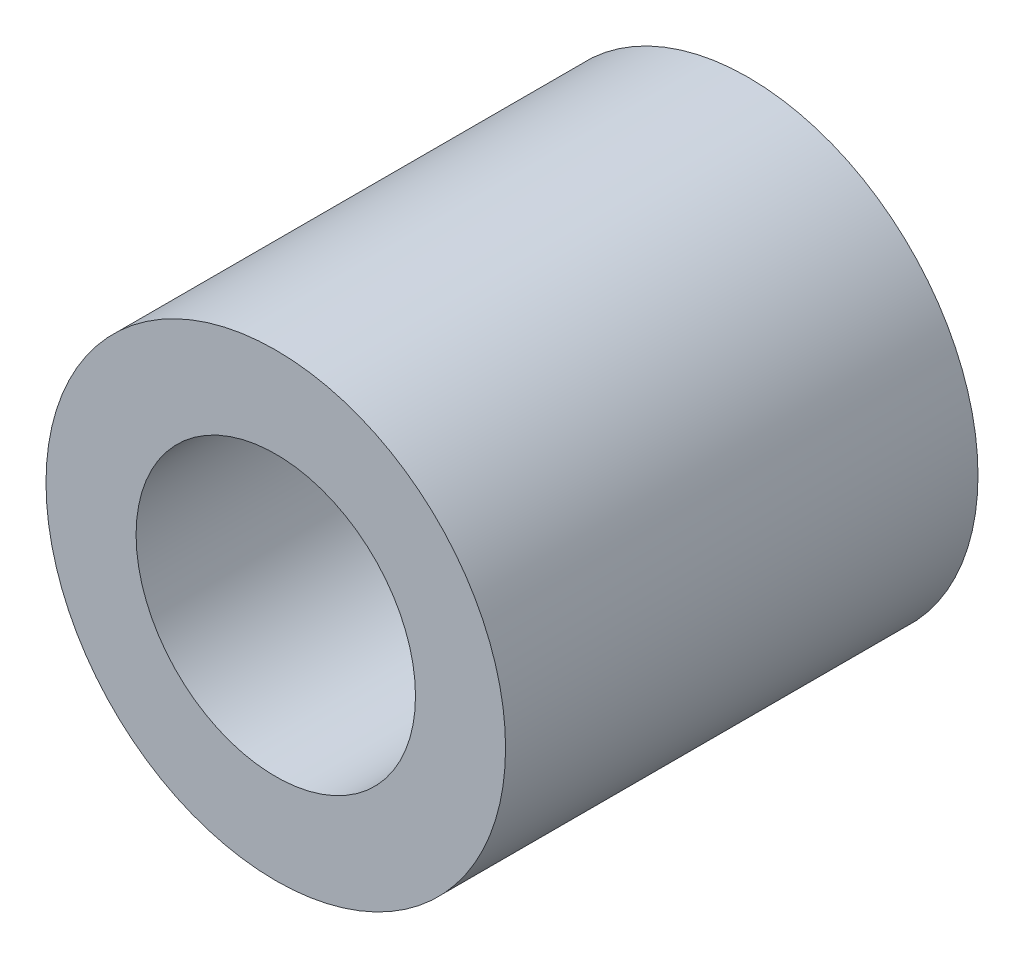
ISO-10303-21;
HEADER;
FILE_DESCRIPTION(('STEP AP214'),'2;1');
FILE_NAME('part.step','',(''),(''),'','','');
FILE_SCHEMA(('AUTOMOTIVE_DESIGN { 1 0 10303 214 1 1 1 1 }'));
ENDSEC;
DATA;
#1=APPLICATION_CONTEXT('core data for automotive mechanical design processes');
#2=APPLICATION_PROTOCOL_DEFINITION('international standard','automotive_design',2000,#1);
#3=PRODUCT_CONTEXT('',#1,'mechanical');
#4=PRODUCT('Part','Part','',(#3));
#5=PRODUCT_RELATED_PRODUCT_CATEGORY('part','',(#4));
#6=PRODUCT_DEFINITION_FORMATION('','',#4);
#7=PRODUCT_DEFINITION_CONTEXT('part definition',#1,'design');
#8=PRODUCT_DEFINITION('design','',#6,#7);
#9=PRODUCT_DEFINITION_SHAPE('','',#8);
#10=(LENGTH_UNIT() NAMED_UNIT(*) SI_UNIT(.MILLI.,.METRE.));
#11=(NAMED_UNIT(*) PLANE_ANGLE_UNIT() SI_UNIT($,.RADIAN.));
#12=(NAMED_UNIT(*) SI_UNIT($,.STERADIAN.) SOLID_ANGLE_UNIT());
#13=UNCERTAINTY_MEASURE_WITH_UNIT(LENGTH_MEASURE(1.E-05),#10,'distance_accuracy_value','');
#14=(GEOMETRIC_REPRESENTATION_CONTEXT(3) GLOBAL_UNCERTAINTY_ASSIGNED_CONTEXT((#13)) GLOBAL_UNIT_ASSIGNED_CONTEXT((#10,
#11,#12)) REPRESENTATION_CONTEXT('',''));
#15=CARTESIAN_POINT('',(0.,0.,0.));
#16=DIRECTION('',(0.,0.,1.));
#17=DIRECTION('',(1.,0.,0.));
#18=AXIS2_PLACEMENT_3D('',#15,#16,#17);
#19=CARTESIAN_POINT('',(0.,0.,25.7));
#20=DIRECTION('',(0.,0.,1.));
#21=DIRECTION('',(1.,0.,0.));
#22=AXIS2_PLACEMENT_3D('',#19,#20,#21);
#23=PLANE('',#22);
#24=CARTESIAN_POINT('',(0.,0.,25.7));
#25=DIRECTION('',(0.,0.,1.));
#26=DIRECTION('',(1.,0.,0.));
#27=AXIS2_PLACEMENT_3D('',#24,#25,#26);
#28=CIRCLE('',#27,12.5);
#29=CARTESIAN_POINT('',(12.5,0.,25.7));
#30=VERTEX_POINT('',#29);
#31=EDGE_CURVE('E10',#30,#30,#28,.T.);
#32=ORIENTED_EDGE('',*,*,#31,.T.);
#33=EDGE_LOOP('',(#32));
#34=FACE_BOUND('',#33,.T.);
#35=CARTESIAN_POINT('',(0.,0.,25.7));
#36=DIRECTION('',(0.,0.,1.));
#37=DIRECTION('',(1.,0.,0.));
#38=AXIS2_PLACEMENT_3D('',#35,#36,#37);
#39=CIRCLE('',#38,7.6);
#40=CARTESIAN_POINT('',(7.6,0.,25.7));
#41=VERTEX_POINT('',#40);
#42=EDGE_CURVE('E42',#41,#41,#39,.T.);
#43=ORIENTED_EDGE('',*,*,#42,.F.);
#44=EDGE_LOOP('',(#43));
#45=FACE_BOUND('',#44,.T.);
#46=ADVANCED_FACE('F31',(#34,#45),#23,.T.);
#47=CARTESIAN_POINT('',(0.,0.,0.));
#48=DIRECTION('',(0.,0.,1.));
#49=DIRECTION('',(1.,0.,0.));
#50=AXIS2_PLACEMENT_3D('',#47,#48,#49);
#51=PLANE('',#50);
#52=CARTESIAN_POINT('',(0.,0.,0.));
#53=DIRECTION('',(0.,0.,1.));
#54=DIRECTION('',(1.,0.,0.));
#55=AXIS2_PLACEMENT_3D('',#52,#53,#54);
#56=CIRCLE('',#55,12.5);
#57=CARTESIAN_POINT('',(12.5,0.,0.));
#58=VERTEX_POINT('',#57);
#59=EDGE_CURVE('E35',#58,#58,#56,.T.);
#60=ORIENTED_EDGE('',*,*,#59,.F.);
#61=EDGE_LOOP('',(#60));
#62=FACE_BOUND('',#61,.T.);
#63=CARTESIAN_POINT('',(0.,0.,0.));
#64=DIRECTION('',(0.,0.,1.));
#65=DIRECTION('',(1.,0.,0.));
#66=AXIS2_PLACEMENT_3D('',#63,#64,#65);
#67=CIRCLE('',#66,7.6);
#68=CARTESIAN_POINT('',(7.6,0.,0.));
#69=VERTEX_POINT('',#68);
#70=EDGE_CURVE('E44',#69,#69,#67,.T.);
#71=ORIENTED_EDGE('',*,*,#70,.T.);
#72=EDGE_LOOP('',(#71));
#73=FACE_BOUND('',#72,.T.);
#74=ADVANCED_FACE('F54',(#62,#73),#51,.F.);
#75=CARTESIAN_POINT('',(0.,0.,25.7));
#76=DIRECTION('',(0.,0.,-1.));
#77=DIRECTION('',(-1.,0.,0.));
#78=AXIS2_PLACEMENT_3D('',#75,#76,#77);
#79=CYLINDRICAL_SURFACE('',#78,12.5);
#80=ORIENTED_EDGE('',*,*,#31,.F.);
#81=EDGE_LOOP('',(#80));
#82=FACE_BOUND('',#81,.T.);
#83=ORIENTED_EDGE('',*,*,#59,.T.);
#84=EDGE_LOOP('',(#83));
#85=FACE_BOUND('',#84,.T.);
#86=ADVANCED_FACE('F33',(#82,#85),#79,.T.);
#87=CARTESIAN_POINT('',(0.,0.,25.7));
#88=DIRECTION('',(0.,0.,-1.));
#89=DIRECTION('',(-1.,0.,0.));
#90=AXIS2_PLACEMENT_3D('',#87,#88,#89);
#91=CYLINDRICAL_SURFACE('',#90,7.6);
#92=ORIENTED_EDGE('',*,*,#42,.T.);
#93=EDGE_LOOP('',(#92));
#94=FACE_BOUND('',#93,.T.);
#95=ORIENTED_EDGE('',*,*,#70,.F.);
#96=EDGE_LOOP('',(#95));
#97=FACE_BOUND('',#96,.T.);
#98=ADVANCED_FACE('F50',(#94,#97),#91,.F.);
#99=CLOSED_SHELL('',(#46,#74,#86,#98));
#100=MANIFOLD_SOLID_BREP('B2',#99);
#101=ADVANCED_BREP_SHAPE_REPRESENTATION('',(#18,#100),#14);
#102=SHAPE_DEFINITION_REPRESENTATION(#9,#101);
ENDSEC;
END-ISO-10303-21;
